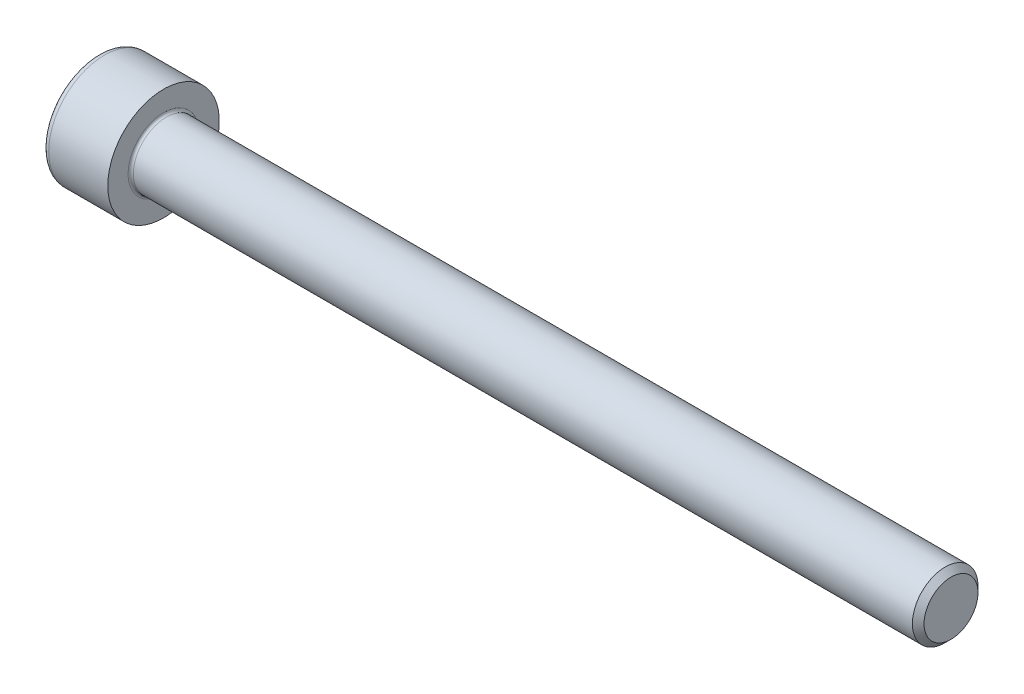
ISO-10303-21;
HEADER;
FILE_DESCRIPTION(('STEP AP214'),'2;1');
FILE_NAME('part.step','',(''),(''),'','','');
FILE_SCHEMA(('AUTOMOTIVE_DESIGN { 1 0 10303 214 1 1 1 1 }'));
ENDSEC;
DATA;
#1=APPLICATION_CONTEXT('core data for automotive mechanical design processes');
#2=APPLICATION_PROTOCOL_DEFINITION('international standard','automotive_design',2000,#1);
#3=PRODUCT_CONTEXT('',#1,'mechanical');
#4=PRODUCT('Part','Part','',(#3));
#5=PRODUCT_RELATED_PRODUCT_CATEGORY('part','',(#4));
#6=PRODUCT_DEFINITION_FORMATION('','',#4);
#7=PRODUCT_DEFINITION_CONTEXT('part definition',#1,'design');
#8=PRODUCT_DEFINITION('design','',#6,#7);
#9=PRODUCT_DEFINITION_SHAPE('','',#8);
#10=(LENGTH_UNIT() NAMED_UNIT(*) SI_UNIT(.MILLI.,.METRE.));
#11=(NAMED_UNIT(*) PLANE_ANGLE_UNIT() SI_UNIT($,.RADIAN.));
#12=(NAMED_UNIT(*) SI_UNIT($,.STERADIAN.) SOLID_ANGLE_UNIT());
#13=UNCERTAINTY_MEASURE_WITH_UNIT(LENGTH_MEASURE(1.E-05),#10,'distance_accuracy_value','');
#14=(GEOMETRIC_REPRESENTATION_CONTEXT(3) GLOBAL_UNCERTAINTY_ASSIGNED_CONTEXT((#13)) GLOBAL_UNIT_ASSIGNED_CONTEXT((#10,
#11,#12)) REPRESENTATION_CONTEXT('',''));
#15=CARTESIAN_POINT('',(0.,0.,0.));
#16=DIRECTION('',(0.,0.,1.));
#17=DIRECTION('',(1.,0.,0.));
#18=AXIS2_PLACEMENT_3D('',#15,#16,#17);
#19=CARTESIAN_POINT('',(0.,0.,0.));
#20=DIRECTION('',(-1.,0.,0.));
#21=DIRECTION('',(0.,0.,1.));
#22=AXIS2_PLACEMENT_3D('',#19,#20,#21);
#23=PLANE('',#22);
#24=DIRECTION('',(0.,-0.499999999999999,0.866025403784439));
#25=VECTOR('',#24,1.);
#26=CARTESIAN_POINT('',(0.,2.32094808214229,0.));
#27=LINE('',#26,#25);
#28=CARTESIAN_POINT('',(0.,2.32094808214229,0.));
#29=VERTEX_POINT('',#28);
#30=CARTESIAN_POINT('',(0.,1.16047404107114,2.01));
#31=VERTEX_POINT('',#30);
#32=EDGE_CURVE('E263',#29,#31,#27,.T.);
#33=ORIENTED_EDGE('',*,*,#32,.T.);
#34=DIRECTION('',(0.,1.,0.));
#35=VECTOR('',#34,1.);
#36=CARTESIAN_POINT('',(0.,-1.16047404107115,2.01));
#37=LINE('',#36,#35);
#38=CARTESIAN_POINT('',(0.,-1.16047404107115,2.01));
#39=VERTEX_POINT('',#38);
#40=EDGE_CURVE('E135',#39,#31,#37,.T.);
#41=ORIENTED_EDGE('',*,*,#40,.F.);
#42=DIRECTION('',(0.,-0.500000000000001,-0.866025403784438));
#43=VECTOR('',#42,1.);
#44=CARTESIAN_POINT('',(0.,-1.16047404107115,2.01));
#45=LINE('',#44,#43);
#46=CARTESIAN_POINT('',(0.,-2.3209480821423,0.));
#47=VERTEX_POINT('',#46);
#48=EDGE_CURVE('E266',#39,#47,#45,.T.);
#49=ORIENTED_EDGE('',*,*,#48,.T.);
#50=DIRECTION('',(0.,0.499999999999998,-0.866025403784439));
#51=VECTOR('',#50,1.);
#52=CARTESIAN_POINT('',(0.,-2.3209480821423,0.));
#53=LINE('',#52,#51);
#54=CARTESIAN_POINT('',(0.,-1.16047404107116,-2.01));
#55=VERTEX_POINT('',#54);
#56=EDGE_CURVE('E269',#47,#55,#53,.T.);
#57=ORIENTED_EDGE('',*,*,#56,.T.);
#58=DIRECTION('',(0.,-1.,0.));
#59=VECTOR('',#58,1.);
#60=CARTESIAN_POINT('',(0.,1.16047404107114,-2.01));
#61=LINE('',#60,#59);
#62=CARTESIAN_POINT('',(0.,1.16047404107114,-2.01));
#63=VERTEX_POINT('',#62);
#64=EDGE_CURVE('E272',#63,#55,#61,.T.);
#65=ORIENTED_EDGE('',*,*,#64,.F.);
#66=DIRECTION('',(0.,-0.500000000000001,-0.866025403784438));
#67=VECTOR('',#66,1.);
#68=CARTESIAN_POINT('',(0.,2.32094808214229,0.));
#69=LINE('',#68,#67);
#70=EDGE_CURVE('E130',#29,#63,#69,.T.);
#71=ORIENTED_EDGE('',*,*,#70,.F.);
#72=EDGE_LOOP('',(#33,#41,#49,#57,#65,#71));
#73=FACE_BOUND('',#72,.T.);
#74=CARTESIAN_POINT('',(0.,0.,0.));
#75=DIRECTION('',(-1.,0.,0.));
#76=DIRECTION('',(0.,0.,1.));
#77=AXIS2_PLACEMENT_3D('',#74,#75,#76);
#78=CIRCLE('',#77,3.75);
#79=CARTESIAN_POINT('',(0.,0.,3.75));
#80=VERTEX_POINT('',#79);
#81=EDGE_CURVE('E47',#80,#80,#78,.T.);
#82=ORIENTED_EDGE('',*,*,#81,.T.);
#83=EDGE_LOOP('',(#82));
#84=FACE_BOUND('',#83,.T.);
#85=ADVANCED_FACE('F39',(#73,#84),#23,.T.);
#86=CARTESIAN_POINT('',(-31.75,0.,0.));
#87=DIRECTION('',(-1.,0.,0.));
#88=DIRECTION('',(0.,0.,1.));
#89=AXIS2_PLACEMENT_3D('',#86,#87,#88);
#90=CYLINDRICAL_SURFACE('',#89,4.25);
#91=CARTESIAN_POINT('',(0.5,0.,0.));
#92=DIRECTION('',(-1.,0.,0.));
#93=DIRECTION('',(0.,0.,1.));
#94=AXIS2_PLACEMENT_3D('',#91,#92,#93);
#95=CIRCLE('',#94,4.25);
#96=CARTESIAN_POINT('',(0.5,0.,4.25));
#97=VERTEX_POINT('',#96);
#98=EDGE_CURVE('E11',#97,#97,#95,.F.);
#99=ORIENTED_EDGE('',*,*,#98,.T.);
#100=EDGE_LOOP('',(#99));
#101=FACE_BOUND('',#100,.T.);
#102=CARTESIAN_POINT('',(5.,0.,0.));
#103=DIRECTION('',(-1.,0.,0.));
#104=DIRECTION('',(0.,0.,1.));
#105=AXIS2_PLACEMENT_3D('',#102,#103,#104);
#106=CIRCLE('',#105,4.25);
#107=CARTESIAN_POINT('',(5.,0.,4.25));
#108=VERTEX_POINT('',#107);
#109=EDGE_CURVE('E153',#108,#108,#106,.T.);
#110=ORIENTED_EDGE('',*,*,#109,.T.);
#111=EDGE_LOOP('',(#110));
#112=FACE_BOUND('',#111,.T.);
#113=ADVANCED_FACE('F177',(#101,#112),#90,.T.);
#114=CARTESIAN_POINT('',(5.,4.25,0.));
#115=DIRECTION('',(1.,0.,0.));
#116=DIRECTION('',(0.,0.,-1.));
#117=AXIS2_PLACEMENT_3D('',#114,#115,#116);
#118=PLANE('',#117);
#119=CARTESIAN_POINT('',(5.,0.,0.));
#120=DIRECTION('',(1.,0.,0.));
#121=DIRECTION('',(0.,0.,-1.));
#122=AXIS2_PLACEMENT_3D('',#119,#120,#121);
#123=CIRCLE('',#122,2.69999999999999);
#124=CARTESIAN_POINT('',(5.,0.,-2.69999999999999));
#125=VERTEX_POINT('',#124);
#126=EDGE_CURVE('E156',#125,#125,#123,.F.);
#127=ORIENTED_EDGE('',*,*,#126,.T.);
#128=EDGE_LOOP('',(#127));
#129=FACE_BOUND('',#128,.T.);
#130=ORIENTED_EDGE('',*,*,#109,.F.);
#131=EDGE_LOOP('',(#130));
#132=FACE_BOUND('',#131,.T.);
#133=ADVANCED_FACE('F183',(#129,#132),#118,.T.);
#134=CARTESIAN_POINT('',(-31.75,0.,0.));
#135=DIRECTION('',(-1.,0.,0.));
#136=DIRECTION('',(0.,0.,1.));
#137=AXIS2_PLACEMENT_3D('',#134,#135,#136);
#138=CYLINDRICAL_SURFACE('',#137,2.49999999999999);
#139=CARTESIAN_POINT('',(5.2,0.,0.));
#140=DIRECTION('',(1.,0.,0.));
#141=DIRECTION('',(0.,0.,-1.));
#142=AXIS2_PLACEMENT_3D('',#139,#140,#141);
#143=CIRCLE('',#142,2.49999999999999);
#144=CARTESIAN_POINT('',(5.2,0.,-2.49999999999999));
#145=VERTEX_POINT('',#144);
#146=EDGE_CURVE('E159',#145,#145,#143,.T.);
#147=ORIENTED_EDGE('',*,*,#146,.T.);
#148=EDGE_LOOP('',(#147));
#149=FACE_BOUND('',#148,.T.);
#150=CARTESIAN_POINT('',(64.555,0.,0.));
#151=DIRECTION('',(-1.,0.,0.));
#152=DIRECTION('',(0.,0.,1.));
#153=AXIS2_PLACEMENT_3D('',#150,#151,#152);
#154=CIRCLE('',#153,2.49999999999998);
#155=CARTESIAN_POINT('',(64.555,0.,2.49999999999998));
#156=VERTEX_POINT('',#155);
#157=EDGE_CURVE('E150',#156,#156,#154,.T.);
#158=ORIENTED_EDGE('',*,*,#157,.T.);
#159=EDGE_LOOP('',(#158));
#160=FACE_BOUND('',#159,.T.);
#161=ADVANCED_FACE('F189',(#149,#160),#138,.T.);
#162=CARTESIAN_POINT('',(65.,0.,0.));
#163=DIRECTION('',(-1.,0.,0.));
#164=DIRECTION('',(0.,0.,1.));
#165=AXIS2_PLACEMENT_3D('',#162,#163,#164);
#166=CONICAL_SURFACE('',#165,2.055,0.785398163397413);
#167=ORIENTED_EDGE('',*,*,#157,.F.);
#168=EDGE_LOOP('',(#167));
#169=FACE_BOUND('',#168,.T.);
#170=CARTESIAN_POINT('',(65.,0.,0.));
#171=DIRECTION('',(-1.,0.,0.));
#172=DIRECTION('',(0.,0.,1.));
#173=AXIS2_PLACEMENT_3D('',#170,#171,#172);
#174=CIRCLE('',#173,2.055);
#175=CARTESIAN_POINT('',(65.,0.,2.055));
#176=VERTEX_POINT('',#175);
#177=EDGE_CURVE('E146',#176,#176,#174,.T.);
#178=ORIENTED_EDGE('',*,*,#177,.T.);
#179=EDGE_LOOP('',(#178));
#180=FACE_BOUND('',#179,.T.);
#181=ADVANCED_FACE('F193',(#169,#180),#166,.T.);
#182=CARTESIAN_POINT('',(65.,2.055,0.));
#183=DIRECTION('',(1.,0.,0.));
#184=DIRECTION('',(0.,0.,-1.));
#185=AXIS2_PLACEMENT_3D('',#182,#183,#184);
#186=PLANE('',#185);
#187=ORIENTED_EDGE('',*,*,#177,.F.);
#188=EDGE_LOOP('',(#187));
#189=FACE_BOUND('',#188,.T.);
#190=ADVANCED_FACE('F173',(#189),#186,.T.);
#191=CARTESIAN_POINT('',(5.2,0.,0.));
#192=DIRECTION('',(1.,0.,0.));
#193=DIRECTION('',(0.,0.,-1.));
#194=AXIS2_PLACEMENT_3D('',#191,#192,#193);
#195=TOROIDAL_SURFACE('',#194,2.69999999999999,0.2);
#196=ORIENTED_EDGE('',*,*,#146,.F.);
#197=EDGE_LOOP('',(#196));
#198=FACE_BOUND('',#197,.T.);
#199=ORIENTED_EDGE('',*,*,#126,.F.);
#200=EDGE_LOOP('',(#199));
#201=FACE_BOUND('',#200,.T.);
#202=ADVANCED_FACE('F166',(#198,#201),#195,.F.);
#203=CARTESIAN_POINT('',(0.5,0.,0.));
#204=DIRECTION('',(-1.,0.,0.));
#205=DIRECTION('',(0.,0.,1.));
#206=AXIS2_PLACEMENT_3D('',#203,#204,#205);
#207=TOROIDAL_SURFACE('',#206,3.75,0.5);
#208=ORIENTED_EDGE('',*,*,#98,.F.);
#209=EDGE_LOOP('',(#208));
#210=FACE_BOUND('',#209,.T.);
#211=ORIENTED_EDGE('',*,*,#81,.F.);
#212=EDGE_LOOP('',(#211));
#213=FACE_BOUND('',#212,.T.);
#214=ADVANCED_FACE('F41',(#210,#213),#207,.T.);
#215=CARTESIAN_POINT('',(2.5,2.32094808214229,0.));
#216=DIRECTION('',(0.,-0.866025403784439,-0.499999999999999));
#217=DIRECTION('',(0.,0.499999999999999,-0.866025403784439));
#218=AXIS2_PLACEMENT_3D('',#215,#216,#217);
#219=PLANE('',#218);
#220=ORIENTED_EDGE('',*,*,#32,.F.);
#221=DIRECTION('',(-1.,0.,0.));
#222=VECTOR('',#221,1.);
#223=CARTESIAN_POINT('',(2.5,2.32094808214229,0.));
#224=LINE('',#223,#222);
#225=CARTESIAN_POINT('',(2.5,2.32094808214229,0.));
#226=VERTEX_POINT('',#225);
#227=EDGE_CURVE('E253',#226,#29,#224,.T.);
#228=ORIENTED_EDGE('',*,*,#227,.F.);
#229=DIRECTION('',(0.,-0.499999999999999,0.866025403784439));
#230=VECTOR('',#229,1.);
#231=CARTESIAN_POINT('',(2.5,2.32094808214229,0.));
#232=LINE('',#231,#230);
#233=CARTESIAN_POINT('',(2.5,1.74071106160672,1.00499999999999));
#234=VERTEX_POINT('',#233);
#235=EDGE_CURVE('E122',#226,#234,#232,.T.);
#236=ORIENTED_EDGE('',*,*,#235,.T.);
#237=CARTESIAN_POINT('',(2.5,1.16047404107114,2.01));
#238=VERTEX_POINT('',#237);
#239=EDGE_CURVE('E113',#234,#238,#232,.T.);
#240=ORIENTED_EDGE('',*,*,#239,.T.);
#241=DIRECTION('',(-1.,0.,0.));
#242=VECTOR('',#241,1.);
#243=CARTESIAN_POINT('',(2.5,1.16047404107114,2.01));
#244=LINE('',#243,#242);
#245=EDGE_CURVE('E127',#238,#31,#244,.T.);
#246=ORIENTED_EDGE('',*,*,#245,.T.);
#247=EDGE_LOOP('',(#220,#228,#236,#240,#246));
#248=FACE_BOUND('',#247,.T.);
#249=ADVANCED_FACE('F126',(#248),#219,.T.);
#250=CARTESIAN_POINT('',(2.5,-1.16047404107115,2.01));
#251=DIRECTION('',(0.,0.,1.));
#252=DIRECTION('',(0.,-1.,0.));
#253=AXIS2_PLACEMENT_3D('',#250,#251,#252);
#254=PLANE('',#253);
#255=ORIENTED_EDGE('',*,*,#40,.T.);
#256=ORIENTED_EDGE('',*,*,#245,.F.);
#257=DIRECTION('',(0.,1.,0.));
#258=VECTOR('',#257,1.);
#259=CARTESIAN_POINT('',(2.5,-1.16047404107115,2.01));
#260=LINE('',#259,#258);
#261=CARTESIAN_POINT('',(2.5,0.,2.01));
#262=VERTEX_POINT('',#261);
#263=EDGE_CURVE('E110',#262,#238,#260,.T.);
#264=ORIENTED_EDGE('',*,*,#263,.F.);
#265=CARTESIAN_POINT('',(2.5,-1.16047404107115,2.01));
#266=VERTEX_POINT('',#265);
#267=EDGE_CURVE('E121',#266,#262,#260,.T.);
#268=ORIENTED_EDGE('',*,*,#267,.F.);
#269=DIRECTION('',(-1.,0.,0.));
#270=VECTOR('',#269,1.);
#271=CARTESIAN_POINT('',(2.5,-1.16047404107115,2.01));
#272=LINE('',#271,#270);
#273=EDGE_CURVE('E137',#266,#39,#272,.T.);
#274=ORIENTED_EDGE('',*,*,#273,.T.);
#275=EDGE_LOOP('',(#255,#256,#264,#268,#274));
#276=FACE_BOUND('',#275,.T.);
#277=ADVANCED_FACE('F132',(#276),#254,.F.);
#278=CARTESIAN_POINT('',(2.5,-1.16047404107115,2.01));
#279=DIRECTION('',(0.,0.866025403784438,-0.500000000000001));
#280=DIRECTION('',(0.,0.500000000000001,0.866025403784438));
#281=AXIS2_PLACEMENT_3D('',#278,#279,#280);
#282=PLANE('',#281);
#283=ORIENTED_EDGE('',*,*,#48,.F.);
#284=ORIENTED_EDGE('',*,*,#273,.F.);
#285=DIRECTION('',(0.,-0.500000000000001,-0.866025403784438));
#286=VECTOR('',#285,1.);
#287=CARTESIAN_POINT('',(2.5,-1.16047404107115,2.01));
#288=LINE('',#287,#286);
#289=CARTESIAN_POINT('',(2.5,-1.74071106160673,1.00500000000001));
#290=VERTEX_POINT('',#289);
#291=EDGE_CURVE('E292',#266,#290,#288,.T.);
#292=ORIENTED_EDGE('',*,*,#291,.T.);
#293=CARTESIAN_POINT('',(2.5,-2.3209480821423,0.));
#294=VERTEX_POINT('',#293);
#295=EDGE_CURVE('E281',#290,#294,#288,.T.);
#296=ORIENTED_EDGE('',*,*,#295,.T.);
#297=DIRECTION('',(-1.,0.,0.));
#298=VECTOR('',#297,1.);
#299=CARTESIAN_POINT('',(2.5,-2.3209480821423,0.));
#300=LINE('',#299,#298);
#301=EDGE_CURVE('E142',#294,#47,#300,.T.);
#302=ORIENTED_EDGE('',*,*,#301,.T.);
#303=EDGE_LOOP('',(#283,#284,#292,#296,#302));
#304=FACE_BOUND('',#303,.T.);
#305=ADVANCED_FACE('F207',(#304),#282,.T.);
#306=CARTESIAN_POINT('',(2.5,-2.3209480821423,0.));
#307=DIRECTION('',(0.,0.866025403784439,0.499999999999998));
#308=DIRECTION('',(0.,-0.499999999999998,0.86602540378444));
#309=AXIS2_PLACEMENT_3D('',#306,#307,#308);
#310=PLANE('',#309);
#311=ORIENTED_EDGE('',*,*,#56,.F.);
#312=ORIENTED_EDGE('',*,*,#301,.F.);
#313=DIRECTION('',(0.,0.499999999999998,-0.866025403784439));
#314=VECTOR('',#313,1.);
#315=CARTESIAN_POINT('',(2.5,-2.3209480821423,0.));
#316=LINE('',#315,#314);
#317=CARTESIAN_POINT('',(2.5,-1.74071106160673,-1.005));
#318=VERTEX_POINT('',#317);
#319=EDGE_CURVE('E259',#294,#318,#316,.T.);
#320=ORIENTED_EDGE('',*,*,#319,.T.);
#321=CARTESIAN_POINT('',(2.5,-1.16047404107116,-2.01));
#322=VERTEX_POINT('',#321);
#323=EDGE_CURVE('E291',#318,#322,#316,.T.);
#324=ORIENTED_EDGE('',*,*,#323,.T.);
#325=DIRECTION('',(-1.,0.,0.));
#326=VECTOR('',#325,1.);
#327=CARTESIAN_POINT('',(2.5,-1.16047404107116,-2.01));
#328=LINE('',#327,#326);
#329=EDGE_CURVE('E252',#322,#55,#328,.T.);
#330=ORIENTED_EDGE('',*,*,#329,.T.);
#331=EDGE_LOOP('',(#311,#312,#320,#324,#330));
#332=FACE_BOUND('',#331,.T.);
#333=ADVANCED_FACE('F210',(#332),#310,.T.);
#334=CARTESIAN_POINT('',(2.5,1.16047404107114,-2.01));
#335=DIRECTION('',(0.,0.,-1.));
#336=DIRECTION('',(0.,1.,0.));
#337=AXIS2_PLACEMENT_3D('',#334,#335,#336);
#338=PLANE('',#337);
#339=ORIENTED_EDGE('',*,*,#64,.T.);
#340=ORIENTED_EDGE('',*,*,#329,.F.);
#341=DIRECTION('',(0.,-1.,0.));
#342=VECTOR('',#341,1.);
#343=CARTESIAN_POINT('',(2.5,1.16047404107114,-2.01));
#344=LINE('',#343,#342);
#345=CARTESIAN_POINT('',(2.5,0.,-2.01));
#346=VERTEX_POINT('',#345);
#347=EDGE_CURVE('E256',#346,#322,#344,.T.);
#348=ORIENTED_EDGE('',*,*,#347,.F.);
#349=CARTESIAN_POINT('',(2.5,1.16047404107114,-2.01));
#350=VERTEX_POINT('',#349);
#351=EDGE_CURVE('E54',#350,#346,#344,.T.);
#352=ORIENTED_EDGE('',*,*,#351,.F.);
#353=DIRECTION('',(-1.,0.,0.));
#354=VECTOR('',#353,1.);
#355=CARTESIAN_POINT('',(2.5,1.16047404107114,-2.01));
#356=LINE('',#355,#354);
#357=EDGE_CURVE('E249',#350,#63,#356,.T.);
#358=ORIENTED_EDGE('',*,*,#357,.T.);
#359=EDGE_LOOP('',(#339,#340,#348,#352,#358));
#360=FACE_BOUND('',#359,.T.);
#361=ADVANCED_FACE('F214',(#360),#338,.F.);
#362=CARTESIAN_POINT('',(2.5,2.32094808214229,0.));
#363=DIRECTION('',(0.,0.866025403784438,-0.500000000000001));
#364=DIRECTION('',(0.,0.500000000000001,0.866025403784438));
#365=AXIS2_PLACEMENT_3D('',#362,#363,#364);
#366=PLANE('',#365);
#367=ORIENTED_EDGE('',*,*,#70,.T.);
#368=ORIENTED_EDGE('',*,*,#357,.F.);
#369=DIRECTION('',(0.,-0.500000000000001,-0.866025403784438));
#370=VECTOR('',#369,1.);
#371=CARTESIAN_POINT('',(2.5,2.32094808214229,0.));
#372=LINE('',#371,#370);
#373=CARTESIAN_POINT('',(2.5,1.74071106160671,-1.005));
#374=VERTEX_POINT('',#373);
#375=EDGE_CURVE('E239',#374,#350,#372,.T.);
#376=ORIENTED_EDGE('',*,*,#375,.F.);
#377=EDGE_CURVE('E245',#226,#374,#372,.T.);
#378=ORIENTED_EDGE('',*,*,#377,.F.);
#379=ORIENTED_EDGE('',*,*,#227,.T.);
#380=EDGE_LOOP('',(#367,#368,#376,#378,#379));
#381=FACE_BOUND('',#380,.T.);
#382=ADVANCED_FACE('F218',(#381),#366,.F.);
#383=CARTESIAN_POINT('',(2.5,2.32094808214229,0.));
#384=DIRECTION('',(1.,0.,0.));
#385=DIRECTION('',(0.,0.,-1.));
#386=AXIS2_PLACEMENT_3D('',#383,#384,#385);
#387=PLANE('',#386);
#388=ORIENTED_EDGE('',*,*,#347,.T.);
#389=ORIENTED_EDGE('',*,*,#323,.F.);
#390=CARTESIAN_POINT('',(2.5,0.,0.));
#391=DIRECTION('',(-1.,0.,0.));
#392=DIRECTION('',(0.,0.,1.));
#393=AXIS2_PLACEMENT_3D('',#390,#391,#392);
#394=CIRCLE('',#393,2.01);
#395=EDGE_CURVE('E287',#346,#318,#394,.T.);
#396=ORIENTED_EDGE('',*,*,#395,.F.);
#397=EDGE_LOOP('',(#388,#389,#396));
#398=FACE_BOUND('',#397,.T.);
#399=ADVANCED_FACE('F222',(#398),#387,.F.);
#400=ORIENTED_EDGE('',*,*,#319,.F.);
#401=ORIENTED_EDGE('',*,*,#295,.F.);
#402=EDGE_CURVE('E140',#318,#290,#394,.T.);
#403=ORIENTED_EDGE('',*,*,#402,.F.);
#404=EDGE_LOOP('',(#400,#401,#403));
#405=FACE_BOUND('',#404,.T.);
#406=ADVANCED_FACE('F225',(#405),#387,.F.);
#407=ORIENTED_EDGE('',*,*,#291,.F.);
#408=ORIENTED_EDGE('',*,*,#267,.T.);
#409=EDGE_CURVE('E136',#290,#262,#394,.T.);
#410=ORIENTED_EDGE('',*,*,#409,.F.);
#411=EDGE_LOOP('',(#407,#408,#410));
#412=FACE_BOUND('',#411,.T.);
#413=ADVANCED_FACE('F230',(#412),#387,.F.);
#414=ORIENTED_EDGE('',*,*,#263,.T.);
#415=ORIENTED_EDGE('',*,*,#239,.F.);
#416=EDGE_CURVE('E116',#262,#234,#394,.T.);
#417=ORIENTED_EDGE('',*,*,#416,.F.);
#418=EDGE_LOOP('',(#414,#415,#417));
#419=FACE_BOUND('',#418,.T.);
#420=ADVANCED_FACE('F112',(#419),#387,.F.);
#421=ORIENTED_EDGE('',*,*,#235,.F.);
#422=ORIENTED_EDGE('',*,*,#377,.T.);
#423=EDGE_CURVE('E147',#234,#374,#394,.T.);
#424=ORIENTED_EDGE('',*,*,#423,.F.);
#425=EDGE_LOOP('',(#421,#422,#424));
#426=FACE_BOUND('',#425,.T.);
#427=ADVANCED_FACE('F233',(#426),#387,.F.);
#428=ORIENTED_EDGE('',*,*,#375,.T.);
#429=ORIENTED_EDGE('',*,*,#351,.T.);
#430=EDGE_CURVE('E242',#374,#346,#394,.T.);
#431=ORIENTED_EDGE('',*,*,#430,.F.);
#432=EDGE_LOOP('',(#428,#429,#431));
#433=FACE_BOUND('',#432,.T.);
#434=ADVANCED_FACE('F203',(#433),#387,.F.);
#435=CARTESIAN_POINT('',(2.5,0.,0.));
#436=DIRECTION('',(-1.,0.,0.));
#437=DIRECTION('',(0.,0.,1.));
#438=AXIS2_PLACEMENT_3D('',#435,#436,#437);
#439=CONICAL_SURFACE('',#438,2.01,1.04719755119659);
#440=CARTESIAN_POINT('',(3.66047404107116,0.,0.));
#441=VERTEX_POINT('',#440);
#442=VERTEX_LOOP('',#441);
#443=FACE_BOUND('',#442,.T.);
#444=ORIENTED_EDGE('',*,*,#416,.T.);
#445=ORIENTED_EDGE('',*,*,#423,.T.);
#446=ORIENTED_EDGE('',*,*,#430,.T.);
#447=ORIENTED_EDGE('',*,*,#395,.T.);
#448=ORIENTED_EDGE('',*,*,#402,.T.);
#449=ORIENTED_EDGE('',*,*,#409,.T.);
#450=EDGE_LOOP('',(#444,#445,#446,#447,#448,#449));
#451=FACE_BOUND('',#450,.T.);
#452=ADVANCED_FACE('F201',(#443,#451),#439,.F.);
#453=CLOSED_SHELL('',(#85,#113,#133,#161,#181,#190,#202,#214,#249,#277,#305,#333,#361,#382,#399,
#406,#413,#420,#427,#434,#452));
#454=MANIFOLD_SOLID_BREP('B2',#453);
#455=ADVANCED_BREP_SHAPE_REPRESENTATION('',(#18,#454),#14);
#456=SHAPE_DEFINITION_REPRESENTATION(#9,#455);
ENDSEC;
END-ISO-10303-21;
